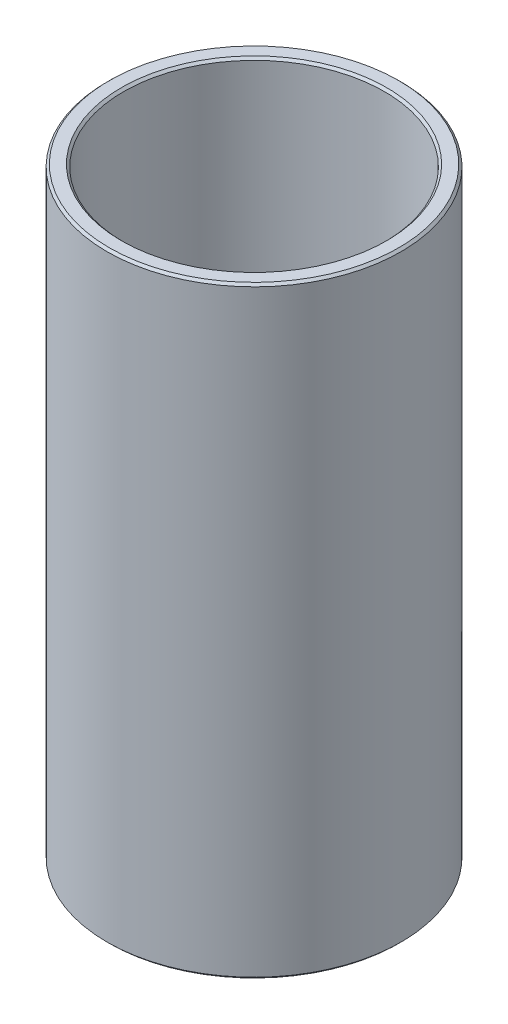
ISO-10303-21;
HEADER;
FILE_DESCRIPTION(('STEP AP214'),'2;1');
FILE_NAME('part.step','',(''),(''),'','','');
FILE_SCHEMA(('AUTOMOTIVE_DESIGN { 1 0 10303 214 1 1 1 1 }'));
ENDSEC;
DATA;
#1=APPLICATION_CONTEXT('core data for automotive mechanical design processes');
#2=APPLICATION_PROTOCOL_DEFINITION('international standard','automotive_design',2000,#1);
#3=PRODUCT_CONTEXT('',#1,'mechanical');
#4=PRODUCT('Part','Part','',(#3));
#5=PRODUCT_RELATED_PRODUCT_CATEGORY('part','',(#4));
#6=PRODUCT_DEFINITION_FORMATION('','',#4);
#7=PRODUCT_DEFINITION_CONTEXT('part definition',#1,'design');
#8=PRODUCT_DEFINITION('design','',#6,#7);
#9=PRODUCT_DEFINITION_SHAPE('','',#8);
#10=(LENGTH_UNIT() NAMED_UNIT(*) SI_UNIT(.MILLI.,.METRE.));
#11=(NAMED_UNIT(*) PLANE_ANGLE_UNIT() SI_UNIT($,.RADIAN.));
#12=(NAMED_UNIT(*) SI_UNIT($,.STERADIAN.) SOLID_ANGLE_UNIT());
#13=UNCERTAINTY_MEASURE_WITH_UNIT(LENGTH_MEASURE(1.E-05),#10,'distance_accuracy_value','');
#14=(GEOMETRIC_REPRESENTATION_CONTEXT(3) GLOBAL_UNCERTAINTY_ASSIGNED_CONTEXT((#13)) GLOBAL_UNIT_ASSIGNED_CONTEXT((#10,
#11,#12)) REPRESENTATION_CONTEXT('',''));
#15=CARTESIAN_POINT('',(0.,0.,0.));
#16=DIRECTION('',(0.,0.,1.));
#17=DIRECTION('',(1.,0.,0.));
#18=AXIS2_PLACEMENT_3D('',#15,#16,#17);
#19=CARTESIAN_POINT('',(0.,153.64274541264,0.));
#20=DIRECTION('',(0.,-1.,0.));
#21=DIRECTION('',(0.,0.,-1.));
#22=AXIS2_PLACEMENT_3D('',#19,#20,#21);
#23=CYLINDRICAL_SURFACE('',#22,37.5);
#24=CARTESIAN_POINT('',(0.,0.580031588343799,0.));
#25=DIRECTION('',(0.,1.,0.));
#26=DIRECTION('',(0.,0.,1.));
#27=AXIS2_PLACEMENT_3D('',#24,#25,#26);
#28=CIRCLE('',#27,37.5);
#29=CARTESIAN_POINT('',(0.,0.580031588343799,37.5));
#30=VERTEX_POINT('',#29);
#31=EDGE_CURVE('E10',#30,#30,#28,.T.);
#32=ORIENTED_EDGE('',*,*,#31,.T.);
#33=EDGE_LOOP('',(#32));
#34=FACE_BOUND('',#33,.T.);
#35=CARTESIAN_POINT('',(0.,153.062713824297,0.));
#36=DIRECTION('',(0.,1.,0.));
#37=DIRECTION('',(0.,0.,1.));
#38=AXIS2_PLACEMENT_3D('',#35,#36,#37);
#39=CIRCLE('',#38,37.5);
#40=CARTESIAN_POINT('',(0.,153.062713824297,37.5));
#41=VERTEX_POINT('',#40);
#42=EDGE_CURVE('E50',#41,#41,#39,.F.);
#43=ORIENTED_EDGE('',*,*,#42,.T.);
#44=EDGE_LOOP('',(#43));
#45=FACE_BOUND('',#44,.T.);
#46=ADVANCED_FACE('F39',(#34,#45),#23,.T.);
#47=CARTESIAN_POINT('',(0.,153.64274541264,0.));
#48=DIRECTION('',(0.,1.,0.));
#49=DIRECTION('',(0.,0.,1.));
#50=AXIS2_PLACEMENT_3D('',#47,#48,#49);
#51=PLANE('',#50);
#52=CARTESIAN_POINT('',(0.,153.64274541264,0.));
#53=DIRECTION('',(0.,1.,0.));
#54=DIRECTION('',(0.,0.,1.));
#55=AXIS2_PLACEMENT_3D('',#52,#53,#54);
#56=CIRCLE('',#55,33.8337806677887);
#57=CARTESIAN_POINT('',(0.,153.64274541264,33.8337806677887));
#58=VERTEX_POINT('',#57);
#59=EDGE_CURVE('E58',#58,#58,#56,.F.);
#60=ORIENTED_EDGE('',*,*,#59,.T.);
#61=EDGE_LOOP('',(#60));
#62=FACE_BOUND('',#61,.T.);
#63=CARTESIAN_POINT('',(0.,153.64274541264,0.));
#64=DIRECTION('',(0.,1.,0.));
#65=DIRECTION('',(0.,0.,1.));
#66=AXIS2_PLACEMENT_3D('',#63,#64,#65);
#67=CIRCLE('',#66,36.9199684116562);
#68=CARTESIAN_POINT('',(0.,153.64274541264,36.9199684116562));
#69=VERTEX_POINT('',#68);
#70=EDGE_CURVE('E61',#69,#69,#67,.T.);
#71=ORIENTED_EDGE('',*,*,#70,.T.);
#72=EDGE_LOOP('',(#71));
#73=FACE_BOUND('',#72,.T.);
#74=ADVANCED_FACE('F88',(#62,#73),#51,.T.);
#75=CARTESIAN_POINT('',(0.,0.,0.));
#76=DIRECTION('',(0.,1.,0.));
#77=DIRECTION('',(0.,0.,1.));
#78=AXIS2_PLACEMENT_3D('',#75,#76,#77);
#79=PLANE('',#78);
#80=CARTESIAN_POINT('',(0.,0.,0.));
#81=DIRECTION('',(0.,1.,0.));
#82=DIRECTION('',(0.,0.,1.));
#83=AXIS2_PLACEMENT_3D('',#80,#81,#82);
#84=CIRCLE('',#83,33.8337806677887);
#85=CARTESIAN_POINT('',(0.,0.,33.8337806677887));
#86=VERTEX_POINT('',#85);
#87=EDGE_CURVE('E51',#86,#86,#84,.T.);
#88=ORIENTED_EDGE('',*,*,#87,.T.);
#89=EDGE_LOOP('',(#88));
#90=FACE_BOUND('',#89,.T.);
#91=CARTESIAN_POINT('',(0.,0.,0.));
#92=DIRECTION('',(0.,1.,0.));
#93=DIRECTION('',(0.,0.,1.));
#94=AXIS2_PLACEMENT_3D('',#91,#92,#93);
#95=CIRCLE('',#94,36.9199684116562);
#96=CARTESIAN_POINT('',(0.,0.,36.9199684116562));
#97=VERTEX_POINT('',#96);
#98=EDGE_CURVE('E54',#97,#97,#95,.F.);
#99=ORIENTED_EDGE('',*,*,#98,.T.);
#100=EDGE_LOOP('',(#99));
#101=FACE_BOUND('',#100,.T.);
#102=ADVANCED_FACE('F83',(#90,#101),#79,.F.);
#103=CARTESIAN_POINT('',(0.,153.64274541264,0.));
#104=DIRECTION('',(0.,-1.,0.));
#105=DIRECTION('',(0.,0.,-1.));
#106=AXIS2_PLACEMENT_3D('',#103,#104,#105);
#107=CYLINDRICAL_SURFACE('',#106,33.2537490794449);
#108=CARTESIAN_POINT('',(0.,153.062713824297,0.));
#109=DIRECTION('',(0.,1.,0.));
#110=DIRECTION('',(0.,0.,1.));
#111=AXIS2_PLACEMENT_3D('',#108,#109,#110);
#112=CIRCLE('',#111,33.2537490794449);
#113=CARTESIAN_POINT('',(0.,153.062713824297,33.2537490794449));
#114=VERTEX_POINT('',#113);
#115=EDGE_CURVE('E67',#114,#114,#112,.T.);
#116=ORIENTED_EDGE('',*,*,#115,.T.);
#117=EDGE_LOOP('',(#116));
#118=FACE_BOUND('',#117,.T.);
#119=CARTESIAN_POINT('',(0.,0.580031588343799,0.));
#120=DIRECTION('',(0.,1.,0.));
#121=DIRECTION('',(0.,0.,1.));
#122=AXIS2_PLACEMENT_3D('',#119,#120,#121);
#123=CIRCLE('',#122,33.2537490794449);
#124=CARTESIAN_POINT('',(0.,0.580031588343799,33.2537490794449));
#125=VERTEX_POINT('',#124);
#126=EDGE_CURVE('E69',#125,#125,#123,.F.);
#127=ORIENTED_EDGE('',*,*,#126,.T.);
#128=EDGE_LOOP('',(#127));
#129=FACE_BOUND('',#128,.T.);
#130=ADVANCED_FACE('F71',(#118,#129),#107,.F.);
#131=CARTESIAN_POINT('',(0.,153.062713824297,0.));
#132=DIRECTION('',(0.,1.,0.));
#133=DIRECTION('',(0.,0.,1.));
#134=AXIS2_PLACEMENT_3D('',#131,#132,#133);
#135=CONICAL_SURFACE('',#134,33.2537490794449,0.785398163397454);
#136=ORIENTED_EDGE('',*,*,#59,.F.);
#137=EDGE_LOOP('',(#136));
#138=FACE_BOUND('',#137,.T.);
#139=ORIENTED_EDGE('',*,*,#115,.F.);
#140=EDGE_LOOP('',(#139));
#141=FACE_BOUND('',#140,.T.);
#142=ADVANCED_FACE('F77',(#138,#141),#135,.F.);
#143=CARTESIAN_POINT('',(0.,0.,0.));
#144=DIRECTION('',(0.,-1.,0.));
#145=DIRECTION('',(0.,0.,-1.));
#146=AXIS2_PLACEMENT_3D('',#143,#144,#145);
#147=CONICAL_SURFACE('',#146,33.8337806677887,0.785398163397454);
#148=ORIENTED_EDGE('',*,*,#126,.F.);
#149=EDGE_LOOP('',(#148));
#150=FACE_BOUND('',#149,.T.);
#151=ORIENTED_EDGE('',*,*,#87,.F.);
#152=EDGE_LOOP('',(#151));
#153=FACE_BOUND('',#152,.T.);
#154=ADVANCED_FACE('F73',(#150,#153),#147,.F.);
#155=CARTESIAN_POINT('',(0.,0.580031588343799,0.));
#156=DIRECTION('',(0.,1.,0.));
#157=DIRECTION('',(0.,0.,1.));
#158=AXIS2_PLACEMENT_3D('',#155,#156,#157);
#159=CONICAL_SURFACE('',#158,37.5,0.785398163397472);
#160=ORIENTED_EDGE('',*,*,#98,.F.);
#161=EDGE_LOOP('',(#160));
#162=FACE_BOUND('',#161,.T.);
#163=ORIENTED_EDGE('',*,*,#31,.F.);
#164=EDGE_LOOP('',(#163));
#165=FACE_BOUND('',#164,.T.);
#166=ADVANCED_FACE('F76',(#162,#165),#159,.T.);
#167=CARTESIAN_POINT('',(0.,153.64274541264,0.));
#168=DIRECTION('',(0.,-1.,0.));
#169=DIRECTION('',(0.,0.,-1.));
#170=AXIS2_PLACEMENT_3D('',#167,#168,#169);
#171=CONICAL_SURFACE('',#170,36.9199684116562,0.785398163397448);
#172=ORIENTED_EDGE('',*,*,#42,.F.);
#173=EDGE_LOOP('',(#172));
#174=FACE_BOUND('',#173,.T.);
#175=ORIENTED_EDGE('',*,*,#70,.F.);
#176=EDGE_LOOP('',(#175));
#177=FACE_BOUND('',#176,.T.);
#178=ADVANCED_FACE('F45',(#174,#177),#171,.T.);
#179=CLOSED_SHELL('',(#46,#74,#102,#130,#142,#154,#166,#178));
#180=MANIFOLD_SOLID_BREP('B2',#179);
#181=ADVANCED_BREP_SHAPE_REPRESENTATION('',(#18,#180),#14);
#182=SHAPE_DEFINITION_REPRESENTATION(#9,#181);
ENDSEC;
END-ISO-10303-21;
